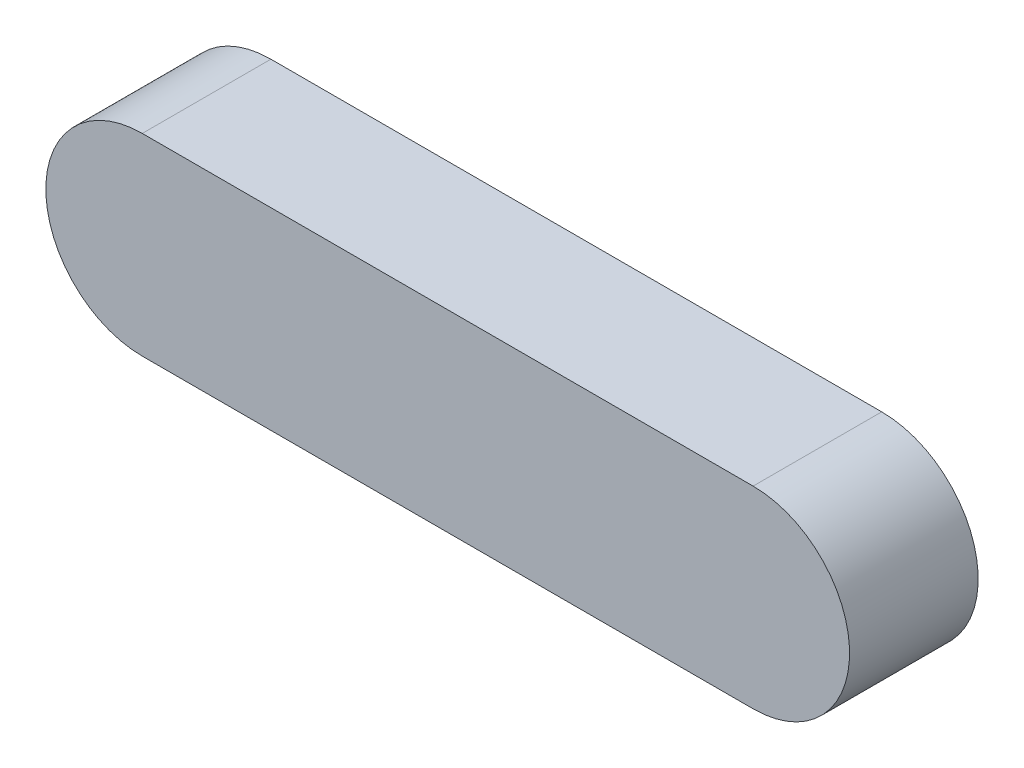
ISO-10303-21;
HEADER;
FILE_DESCRIPTION(('STEP AP214'),'2;1');
FILE_NAME('part.step','',(''),(''),'','','');
FILE_SCHEMA(('AUTOMOTIVE_DESIGN { 1 0 10303 214 1 1 1 1 }'));
ENDSEC;
DATA;
#1=APPLICATION_CONTEXT('core data for automotive mechanical design processes');
#2=APPLICATION_PROTOCOL_DEFINITION('international standard','automotive_design',2000,#1);
#3=PRODUCT_CONTEXT('',#1,'mechanical');
#4=PRODUCT('Part','Part','',(#3));
#5=PRODUCT_RELATED_PRODUCT_CATEGORY('part','',(#4));
#6=PRODUCT_DEFINITION_FORMATION('','',#4);
#7=PRODUCT_DEFINITION_CONTEXT('part definition',#1,'design');
#8=PRODUCT_DEFINITION('design','',#6,#7);
#9=PRODUCT_DEFINITION_SHAPE('','',#8);
#10=(LENGTH_UNIT() NAMED_UNIT(*) SI_UNIT(.MILLI.,.METRE.));
#11=(NAMED_UNIT(*) PLANE_ANGLE_UNIT() SI_UNIT($,.RADIAN.));
#12=(NAMED_UNIT(*) SI_UNIT($,.STERADIAN.) SOLID_ANGLE_UNIT());
#13=UNCERTAINTY_MEASURE_WITH_UNIT(LENGTH_MEASURE(1.E-05),#10,'distance_accuracy_value','');
#14=(GEOMETRIC_REPRESENTATION_CONTEXT(3) GLOBAL_UNCERTAINTY_ASSIGNED_CONTEXT((#13)) GLOBAL_UNIT_ASSIGNED_CONTEXT((#10,
#11,#12)) REPRESENTATION_CONTEXT('',''));
#15=CARTESIAN_POINT('',(0.,0.,0.));
#16=DIRECTION('',(0.,0.,1.));
#17=DIRECTION('',(1.,0.,0.));
#18=AXIS2_PLACEMENT_3D('',#15,#16,#17);
#19=CARTESIAN_POINT('',(-19.,0.,8.));
#20=DIRECTION('',(0.,0.,-1.));
#21=DIRECTION('',(-1.,0.,0.));
#22=AXIS2_PLACEMENT_3D('',#19,#20,#21);
#23=CYLINDRICAL_SURFACE('',#22,6.);
#24=CARTESIAN_POINT('',(-19.,0.,0.));
#25=DIRECTION('',(0.,0.,1.));
#26=DIRECTION('',(1.,0.,0.));
#27=AXIS2_PLACEMENT_3D('',#24,#25,#26);
#28=CIRCLE('',#27,6.);
#29=CARTESIAN_POINT('',(-19.,6.,0.));
#30=VERTEX_POINT('',#29);
#31=CARTESIAN_POINT('',(-19.,-6.,0.));
#32=VERTEX_POINT('',#31);
#33=EDGE_CURVE('E83',#30,#32,#28,.T.);
#34=ORIENTED_EDGE('',*,*,#33,.T.);
#35=DIRECTION('',(0.,0.,-1.));
#36=VECTOR('',#35,1.);
#37=CARTESIAN_POINT('',(-19.,-6.,8.));
#38=LINE('',#37,#36);
#39=CARTESIAN_POINT('',(-19.,-6.,8.));
#40=VERTEX_POINT('',#39);
#41=EDGE_CURVE('E11',#40,#32,#38,.T.);
#42=ORIENTED_EDGE('',*,*,#41,.F.);
#43=CARTESIAN_POINT('',(-19.,0.,8.));
#44=DIRECTION('',(0.,0.,1.));
#45=DIRECTION('',(1.,0.,0.));
#46=AXIS2_PLACEMENT_3D('',#43,#44,#45);
#47=CIRCLE('',#46,6.);
#48=CARTESIAN_POINT('',(-19.,6.,8.));
#49=VERTEX_POINT('',#48);
#50=EDGE_CURVE('E99',#49,#40,#47,.T.);
#51=ORIENTED_EDGE('',*,*,#50,.F.);
#52=DIRECTION('',(0.,0.,-1.));
#53=VECTOR('',#52,1.);
#54=CARTESIAN_POINT('',(-19.,6.,8.));
#55=LINE('',#54,#53);
#56=EDGE_CURVE('E43',#49,#30,#55,.T.);
#57=ORIENTED_EDGE('',*,*,#56,.T.);
#58=EDGE_LOOP('',(#34,#42,#51,#57));
#59=FACE_BOUND('',#58,.T.);
#60=ADVANCED_FACE('F35',(#59),#23,.T.);
#61=CARTESIAN_POINT('',(0.,-6.,8.));
#62=DIRECTION('',(0.,1.,0.));
#63=DIRECTION('',(-1.,0.,0.));
#64=AXIS2_PLACEMENT_3D('',#61,#62,#63);
#65=PLANE('',#64);
#66=DIRECTION('',(1.,0.,0.));
#67=VECTOR('',#66,1.);
#68=CARTESIAN_POINT('',(0.,-6.,0.));
#69=LINE('',#68,#67);
#70=CARTESIAN_POINT('',(19.,-6.,0.));
#71=VERTEX_POINT('',#70);
#72=EDGE_CURVE('E63',#32,#71,#69,.T.);
#73=ORIENTED_EDGE('',*,*,#72,.T.);
#74=DIRECTION('',(0.,0.,-1.));
#75=VECTOR('',#74,1.);
#76=CARTESIAN_POINT('',(19.,-6.,8.));
#77=LINE('',#76,#75);
#78=CARTESIAN_POINT('',(19.,-6.,8.));
#79=VERTEX_POINT('',#78);
#80=EDGE_CURVE('E78',#79,#71,#77,.T.);
#81=ORIENTED_EDGE('',*,*,#80,.F.);
#82=DIRECTION('',(1.,0.,0.));
#83=VECTOR('',#82,1.);
#84=CARTESIAN_POINT('',(0.,-6.,8.));
#85=LINE('',#84,#83);
#86=EDGE_CURVE('E68',#40,#79,#85,.T.);
#87=ORIENTED_EDGE('',*,*,#86,.F.);
#88=ORIENTED_EDGE('',*,*,#41,.T.);
#89=EDGE_LOOP('',(#73,#81,#87,#88));
#90=FACE_BOUND('',#89,.T.);
#91=ADVANCED_FACE('F77',(#90),#65,.F.);
#92=CARTESIAN_POINT('',(-19.,6.,8.));
#93=DIRECTION('',(0.,-1.,0.));
#94=DIRECTION('',(1.,0.,0.));
#95=AXIS2_PLACEMENT_3D('',#92,#93,#94);
#96=PLANE('',#95);
#97=DIRECTION('',(-1.,0.,0.));
#98=VECTOR('',#97,1.);
#99=CARTESIAN_POINT('',(-19.,6.,0.));
#100=LINE('',#99,#98);
#101=CARTESIAN_POINT('',(19.,6.,0.));
#102=VERTEX_POINT('',#101);
#103=EDGE_CURVE('E82',#102,#30,#100,.T.);
#104=ORIENTED_EDGE('',*,*,#103,.T.);
#105=ORIENTED_EDGE('',*,*,#56,.F.);
#106=DIRECTION('',(-1.,0.,0.));
#107=VECTOR('',#106,1.);
#108=CARTESIAN_POINT('',(-19.,6.,8.));
#109=LINE('',#108,#107);
#110=CARTESIAN_POINT('',(19.,6.,8.));
#111=VERTEX_POINT('',#110);
#112=EDGE_CURVE('E51',#111,#49,#109,.T.);
#113=ORIENTED_EDGE('',*,*,#112,.F.);
#114=DIRECTION('',(0.,0.,-1.));
#115=VECTOR('',#114,1.);
#116=CARTESIAN_POINT('',(19.,6.,8.));
#117=LINE('',#116,#115);
#118=EDGE_CURVE('E91',#111,#102,#117,.T.);
#119=ORIENTED_EDGE('',*,*,#118,.T.);
#120=EDGE_LOOP('',(#104,#105,#113,#119));
#121=FACE_BOUND('',#120,.T.);
#122=ADVANCED_FACE('F108',(#121),#96,.F.);
#123=CARTESIAN_POINT('',(-19.,0.,8.));
#124=DIRECTION('',(0.,0.,1.));
#125=DIRECTION('',(1.,0.,0.));
#126=AXIS2_PLACEMENT_3D('',#123,#124,#125);
#127=PLANE('',#126);
#128=ORIENTED_EDGE('',*,*,#50,.T.);
#129=ORIENTED_EDGE('',*,*,#86,.T.);
#130=CARTESIAN_POINT('',(19.,0.,8.));
#131=DIRECTION('',(0.,0.,-1.));
#132=DIRECTION('',(-1.,0.,0.));
#133=AXIS2_PLACEMENT_3D('',#130,#131,#132);
#134=CIRCLE('',#133,6.);
#135=EDGE_CURVE('E90',#111,#79,#134,.T.);
#136=ORIENTED_EDGE('',*,*,#135,.F.);
#137=ORIENTED_EDGE('',*,*,#112,.T.);
#138=EDGE_LOOP('',(#128,#129,#136,#137));
#139=FACE_BOUND('',#138,.T.);
#140=ADVANCED_FACE('F109',(#139),#127,.T.);
#141=CARTESIAN_POINT('',(-19.,0.,0.));
#142=DIRECTION('',(0.,0.,1.));
#143=DIRECTION('',(1.,0.,0.));
#144=AXIS2_PLACEMENT_3D('',#141,#142,#143);
#145=PLANE('',#144);
#146=ORIENTED_EDGE('',*,*,#33,.F.);
#147=ORIENTED_EDGE('',*,*,#103,.F.);
#148=CARTESIAN_POINT('',(19.,0.,0.));
#149=DIRECTION('',(0.,0.,-1.));
#150=DIRECTION('',(-1.,0.,0.));
#151=AXIS2_PLACEMENT_3D('',#148,#149,#150);
#152=CIRCLE('',#151,6.);
#153=EDGE_CURVE('E89',#102,#71,#152,.T.);
#154=ORIENTED_EDGE('',*,*,#153,.T.);
#155=ORIENTED_EDGE('',*,*,#72,.F.);
#156=EDGE_LOOP('',(#146,#147,#154,#155));
#157=FACE_BOUND('',#156,.T.);
#158=ADVANCED_FACE('F93',(#157),#145,.F.);
#159=CARTESIAN_POINT('',(19.,0.,8.));
#160=DIRECTION('',(0.,0.,-1.));
#161=DIRECTION('',(-1.,0.,0.));
#162=AXIS2_PLACEMENT_3D('',#159,#160,#161);
#163=CYLINDRICAL_SURFACE('',#162,6.);
#164=ORIENTED_EDGE('',*,*,#153,.F.);
#165=ORIENTED_EDGE('',*,*,#118,.F.);
#166=ORIENTED_EDGE('',*,*,#135,.T.);
#167=ORIENTED_EDGE('',*,*,#80,.T.);
#168=EDGE_LOOP('',(#164,#165,#166,#167));
#169=FACE_BOUND('',#168,.T.);
#170=ADVANCED_FACE('F87',(#169),#163,.T.);
#171=CLOSED_SHELL('',(#60,#91,#122,#140,#158,#170));
#172=MANIFOLD_SOLID_BREP('B2',#171);
#173=ADVANCED_BREP_SHAPE_REPRESENTATION('',(#18,#172),#14);
#174=SHAPE_DEFINITION_REPRESENTATION(#9,#173);
ENDSEC;
END-ISO-10303-21;
